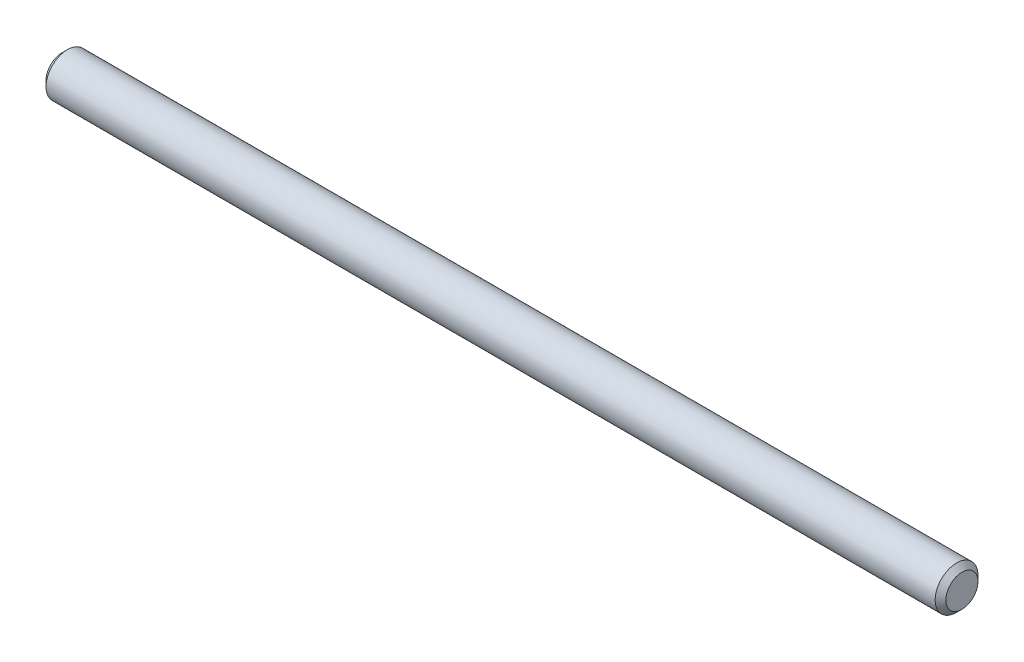
ISO-10303-21;
HEADER;
FILE_DESCRIPTION(('STEP AP214'),'2;1');
FILE_NAME('part.step','',(''),(''),'','','');
FILE_SCHEMA(('AUTOMOTIVE_DESIGN { 1 0 10303 214 1 1 1 1 }'));
ENDSEC;
DATA;
#1=APPLICATION_CONTEXT('core data for automotive mechanical design processes');
#2=APPLICATION_PROTOCOL_DEFINITION('international standard','automotive_design',2000,#1);
#3=PRODUCT_CONTEXT('',#1,'mechanical');
#4=PRODUCT('Part','Part','',(#3));
#5=PRODUCT_RELATED_PRODUCT_CATEGORY('part','',(#4));
#6=PRODUCT_DEFINITION_FORMATION('','',#4);
#7=PRODUCT_DEFINITION_CONTEXT('part definition',#1,'design');
#8=PRODUCT_DEFINITION('design','',#6,#7);
#9=PRODUCT_DEFINITION_SHAPE('','',#8);
#10=(LENGTH_UNIT() NAMED_UNIT(*) SI_UNIT(.MILLI.,.METRE.));
#11=(NAMED_UNIT(*) PLANE_ANGLE_UNIT() SI_UNIT($,.RADIAN.));
#12=(NAMED_UNIT(*) SI_UNIT($,.STERADIAN.) SOLID_ANGLE_UNIT());
#13=UNCERTAINTY_MEASURE_WITH_UNIT(LENGTH_MEASURE(1.E-05),#10,'distance_accuracy_value','');
#14=(GEOMETRIC_REPRESENTATION_CONTEXT(3) GLOBAL_UNCERTAINTY_ASSIGNED_CONTEXT((#13)) GLOBAL_UNIT_ASSIGNED_CONTEXT((#10,
#11,#12)) REPRESENTATION_CONTEXT('',''));
#15=CARTESIAN_POINT('',(0.,0.,0.));
#16=DIRECTION('',(0.,0.,1.));
#17=DIRECTION('',(1.,0.,0.));
#18=AXIS2_PLACEMENT_3D('',#15,#16,#17);
#19=CARTESIAN_POINT('',(84.,0.,0.));
#20=DIRECTION('',(-1.,0.,0.));
#21=DIRECTION('',(0.,0.,1.));
#22=AXIS2_PLACEMENT_3D('',#19,#20,#21);
#23=CYLINDRICAL_SURFACE('',#22,2.);
#24=CARTESIAN_POINT('',(83.5,0.,0.));
#25=DIRECTION('',(1.,0.,0.));
#26=DIRECTION('',(0.,0.,-1.));
#27=AXIS2_PLACEMENT_3D('',#24,#25,#26);
#28=CIRCLE('',#27,2.);
#29=CARTESIAN_POINT('',(83.5,0.,-2.));
#30=VERTEX_POINT('',#29);
#31=EDGE_CURVE('E43',#30,#30,#28,.F.);
#32=ORIENTED_EDGE('',*,*,#31,.T.);
#33=EDGE_LOOP('',(#32));
#34=FACE_BOUND('',#33,.T.);
#35=CARTESIAN_POINT('',(0.500000000000042,0.,0.));
#36=DIRECTION('',(1.,0.,0.));
#37=DIRECTION('',(0.,0.,-1.));
#38=AXIS2_PLACEMENT_3D('',#35,#36,#37);
#39=CIRCLE('',#38,2.);
#40=CARTESIAN_POINT('',(0.500000000000042,0.,-2.));
#41=VERTEX_POINT('',#40);
#42=EDGE_CURVE('E47',#41,#41,#39,.T.);
#43=ORIENTED_EDGE('',*,*,#42,.T.);
#44=EDGE_LOOP('',(#43));
#45=FACE_BOUND('',#44,.T.);
#46=ADVANCED_FACE('F36',(#34,#45),#23,.T.);
#47=CARTESIAN_POINT('',(84.,0.,0.));
#48=DIRECTION('',(1.,0.,0.));
#49=DIRECTION('',(0.,0.,-1.));
#50=AXIS2_PLACEMENT_3D('',#47,#48,#49);
#51=PLANE('',#50);
#52=CARTESIAN_POINT('',(84.,0.,0.));
#53=DIRECTION('',(1.,0.,0.));
#54=DIRECTION('',(0.,0.,-1.));
#55=AXIS2_PLACEMENT_3D('',#52,#53,#54);
#56=CIRCLE('',#55,1.50000000000003);
#57=CARTESIAN_POINT('',(84.,0.,-1.50000000000003));
#58=VERTEX_POINT('',#57);
#59=EDGE_CURVE('E51',#58,#58,#56,.T.);
#60=ORIENTED_EDGE('',*,*,#59,.T.);
#61=EDGE_LOOP('',(#60));
#62=FACE_BOUND('',#61,.T.);
#63=ADVANCED_FACE('F57',(#62),#51,.T.);
#64=CARTESIAN_POINT('',(0.,0.,0.));
#65=DIRECTION('',(1.,0.,0.));
#66=DIRECTION('',(0.,0.,-1.));
#67=AXIS2_PLACEMENT_3D('',#64,#65,#66);
#68=PLANE('',#67);
#69=CARTESIAN_POINT('',(0.,0.,0.));
#70=DIRECTION('',(1.,0.,0.));
#71=DIRECTION('',(0.,0.,-1.));
#72=AXIS2_PLACEMENT_3D('',#69,#70,#71);
#73=CIRCLE('',#72,1.49999999999995);
#74=CARTESIAN_POINT('',(0.,0.,-1.49999999999995));
#75=VERTEX_POINT('',#74);
#76=EDGE_CURVE('E10',#75,#75,#73,.F.);
#77=ORIENTED_EDGE('',*,*,#76,.T.);
#78=EDGE_LOOP('',(#77));
#79=FACE_BOUND('',#78,.T.);
#80=ADVANCED_FACE('F61',(#79),#68,.F.);
#81=CARTESIAN_POINT('',(84.,0.,0.));
#82=DIRECTION('',(-1.,0.,0.));
#83=DIRECTION('',(0.,0.,1.));
#84=AXIS2_PLACEMENT_3D('',#81,#82,#83);
#85=CONICAL_SURFACE('',#84,1.50000000000003,0.785398163397449);
#86=ORIENTED_EDGE('',*,*,#31,.F.);
#87=EDGE_LOOP('',(#86));
#88=FACE_BOUND('',#87,.T.);
#89=ORIENTED_EDGE('',*,*,#59,.F.);
#90=EDGE_LOOP('',(#89));
#91=FACE_BOUND('',#90,.T.);
#92=ADVANCED_FACE('F59',(#88,#91),#85,.T.);
#93=CARTESIAN_POINT('',(0.500000000000042,0.,0.));
#94=DIRECTION('',(1.,0.,0.));
#95=DIRECTION('',(0.,0.,-1.));
#96=AXIS2_PLACEMENT_3D('',#93,#94,#95);
#97=CONICAL_SURFACE('',#96,2.,0.785398163397456);
#98=ORIENTED_EDGE('',*,*,#76,.F.);
#99=EDGE_LOOP('',(#98));
#100=FACE_BOUND('',#99,.T.);
#101=ORIENTED_EDGE('',*,*,#42,.F.);
#102=EDGE_LOOP('',(#101));
#103=FACE_BOUND('',#102,.T.);
#104=ADVANCED_FACE('F38',(#100,#103),#97,.T.);
#105=CLOSED_SHELL('',(#46,#63,#80,#92,#104));
#106=MANIFOLD_SOLID_BREP('B2',#105);
#107=ADVANCED_BREP_SHAPE_REPRESENTATION('',(#18,#106),#14);
#108=SHAPE_DEFINITION_REPRESENTATION(#9,#107);
ENDSEC;
END-ISO-10303-21;
